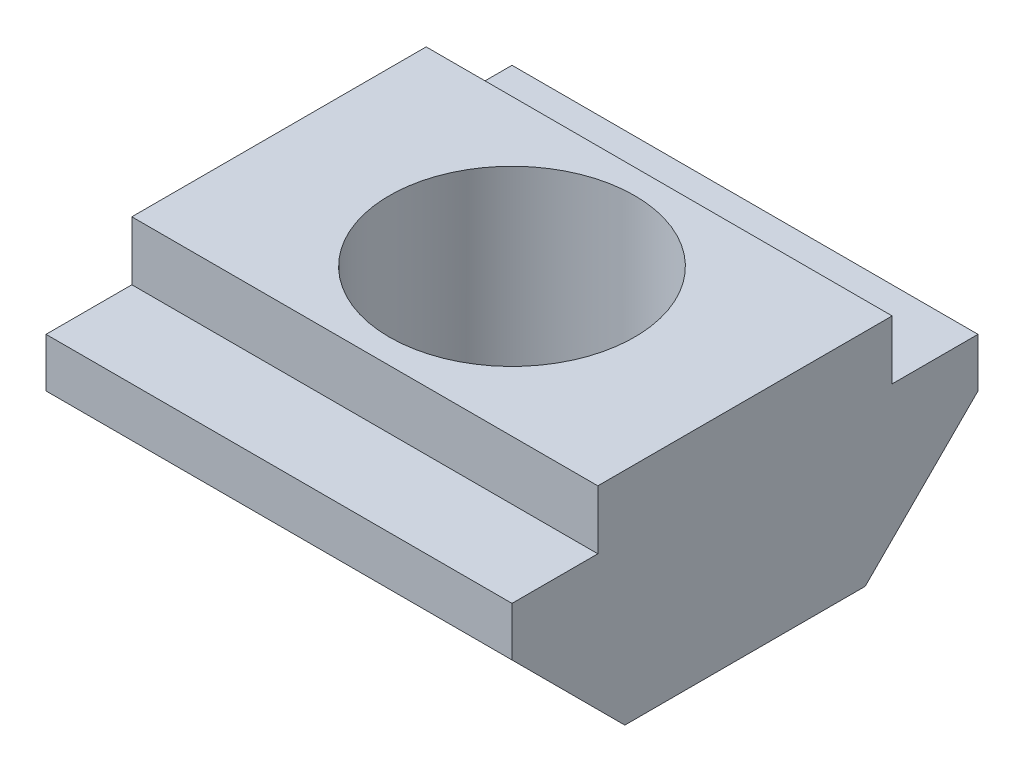
ISO-10303-21;
HEADER;
FILE_DESCRIPTION(('STEP AP214'),'2;1');
FILE_NAME('part.step','',(''),(''),'','','');
FILE_SCHEMA(('AUTOMOTIVE_DESIGN { 1 0 10303 214 1 1 1 1 }'));
ENDSEC;
DATA;
#1=APPLICATION_CONTEXT('core data for automotive mechanical design processes');
#2=APPLICATION_PROTOCOL_DEFINITION('international standard','automotive_design',2000,#1);
#3=PRODUCT_CONTEXT('',#1,'mechanical');
#4=PRODUCT('Part','Part','',(#3));
#5=PRODUCT_RELATED_PRODUCT_CATEGORY('part','',(#4));
#6=PRODUCT_DEFINITION_FORMATION('','',#4);
#7=PRODUCT_DEFINITION_CONTEXT('part definition',#1,'design');
#8=PRODUCT_DEFINITION('design','',#6,#7);
#9=PRODUCT_DEFINITION_SHAPE('','',#8);
#10=(LENGTH_UNIT() NAMED_UNIT(*) SI_UNIT(.MILLI.,.METRE.));
#11=(NAMED_UNIT(*) PLANE_ANGLE_UNIT() SI_UNIT($,.RADIAN.));
#12=(NAMED_UNIT(*) SI_UNIT($,.STERADIAN.) SOLID_ANGLE_UNIT());
#13=UNCERTAINTY_MEASURE_WITH_UNIT(LENGTH_MEASURE(1.E-05),#10,'distance_accuracy_value','');
#14=(GEOMETRIC_REPRESENTATION_CONTEXT(3) GLOBAL_UNCERTAINTY_ASSIGNED_CONTEXT((#13)) GLOBAL_UNIT_ASSIGNED_CONTEXT((#10,
#11,#12)) REPRESENTATION_CONTEXT('',''));
#15=CARTESIAN_POINT('',(0.,0.,0.));
#16=DIRECTION('',(0.,0.,1.));
#17=DIRECTION('',(1.,0.,0.));
#18=AXIS2_PLACEMENT_3D('',#15,#16,#17);
#19=CARTESIAN_POINT('',(0.,0.,0.));
#20=DIRECTION('',(0.,1.,0.));
#21=DIRECTION('',(0.,0.,1.));
#22=AXIS2_PLACEMENT_3D('',#19,#20,#21);
#23=PLANE('',#22);
#24=DIRECTION('',(0.,0.,1.));
#25=VECTOR('',#24,1.);
#26=CARTESIAN_POINT('',(0.,0.,-9.5));
#27=LINE('',#26,#25);
#28=CARTESIAN_POINT('',(0.,0.,-7.20000000000001));
#29=VERTEX_POINT('',#28);
#30=CARTESIAN_POINT('',(0.,0.,-2.30000000000002));
#31=VERTEX_POINT('',#30);
#32=EDGE_CURVE('E154',#29,#31,#27,.T.);
#33=ORIENTED_EDGE('',*,*,#32,.F.);
#34=DIRECTION('',(-1.,0.,0.));
#35=VECTOR('',#34,1.);
#36=CARTESIAN_POINT('',(9.5,0.,-7.20000000000001));
#37=LINE('',#36,#35);
#38=CARTESIAN_POINT('',(4.25250628144672,0.,-7.20000000000001));
#39=VERTEX_POINT('',#38);
#40=EDGE_CURVE('E135',#39,#29,#37,.T.);
#41=ORIENTED_EDGE('',*,*,#40,.F.);
#42=CARTESIAN_POINT('',(4.75,0.,-4.75));
#43=DIRECTION('',(0.,1.,0.));
#44=DIRECTION('',(0.,0.,1.));
#45=AXIS2_PLACEMENT_3D('',#42,#43,#44);
#46=CIRCLE('',#45,2.5);
#47=CARTESIAN_POINT('',(4.25250628144657,0.,-2.30000000000002));
#48=VERTEX_POINT('',#47);
#49=EDGE_CURVE('E185',#39,#48,#46,.T.);
#50=ORIENTED_EDGE('',*,*,#49,.T.);
#51=DIRECTION('',(-1.,0.,0.));
#52=VECTOR('',#51,1.);
#53=CARTESIAN_POINT('',(9.5,0.,-2.30000000000002));
#54=LINE('',#53,#52);
#55=EDGE_CURVE('E55',#48,#31,#54,.T.);
#56=ORIENTED_EDGE('',*,*,#55,.T.);
#57=EDGE_LOOP('',(#33,#41,#50,#56));
#58=FACE_BOUND('',#57,.T.);
#59=ADVANCED_FACE('F39',(#58),#23,.F.);
#60=CARTESIAN_POINT('',(0.,3.3,0.));
#61=DIRECTION('',(0.,1.,0.));
#62=DIRECTION('',(0.,0.,1.));
#63=AXIS2_PLACEMENT_3D('',#60,#61,#62);
#64=PLANE('',#63);
#65=DIRECTION('',(-1.,0.,0.));
#66=VECTOR('',#65,1.);
#67=CARTESIAN_POINT('',(9.5,3.3,-7.75));
#68=LINE('',#67,#66);
#69=CARTESIAN_POINT('',(9.5,3.3,-7.75));
#70=VERTEX_POINT('',#69);
#71=CARTESIAN_POINT('',(0.,3.3,-7.75));
#72=VERTEX_POINT('',#71);
#73=EDGE_CURVE('E206',#70,#72,#68,.T.);
#74=ORIENTED_EDGE('',*,*,#73,.F.);
#75=DIRECTION('',(0.,0.,-1.));
#76=VECTOR('',#75,1.);
#77=CARTESIAN_POINT('',(9.5,3.3,0.));
#78=LINE('',#77,#76);
#79=CARTESIAN_POINT('',(9.5,3.3,-9.5));
#80=VERTEX_POINT('',#79);
#81=EDGE_CURVE('E240',#70,#80,#78,.T.);
#82=ORIENTED_EDGE('',*,*,#81,.T.);
#83=DIRECTION('',(-1.,0.,0.));
#84=VECTOR('',#83,1.);
#85=CARTESIAN_POINT('',(9.5,3.3,-9.5));
#86=LINE('',#85,#84);
#87=CARTESIAN_POINT('',(0.,3.3,-9.5));
#88=VERTEX_POINT('',#87);
#89=EDGE_CURVE('E170',#80,#88,#86,.T.);
#90=ORIENTED_EDGE('',*,*,#89,.T.);
#91=DIRECTION('',(0.,0.,1.));
#92=VECTOR('',#91,1.);
#93=CARTESIAN_POINT('',(0.,3.3,-9.5));
#94=LINE('',#93,#92);
#95=EDGE_CURVE('E158',#88,#72,#94,.T.);
#96=ORIENTED_EDGE('',*,*,#95,.T.);
#97=EDGE_LOOP('',(#74,#82,#90,#96));
#98=FACE_BOUND('',#97,.T.);
#99=ADVANCED_FACE('F247',(#98),#64,.T.);
#100=CARTESIAN_POINT('',(0.,3.3,-9.5));
#101=DIRECTION('',(1.,0.,0.));
#102=DIRECTION('',(0.,0.,-1.));
#103=AXIS2_PLACEMENT_3D('',#100,#101,#102);
#104=PLANE('',#103);
#105=DIRECTION('',(0.,-1.,0.));
#106=VECTOR('',#105,1.);
#107=CARTESIAN_POINT('',(0.,3.3,-9.5));
#108=LINE('',#107,#106);
#109=CARTESIAN_POINT('',(0.,2.3,-9.5));
#110=VERTEX_POINT('',#109);
#111=EDGE_CURVE('E165',#88,#110,#108,.T.);
#112=ORIENTED_EDGE('',*,*,#111,.T.);
#113=DIRECTION('',(0.,0.707106781186549,-0.707106781186546));
#114=VECTOR('',#113,1.);
#115=CARTESIAN_POINT('',(0.,2.3,-9.5));
#116=LINE('',#115,#114);
#117=EDGE_CURVE('E136',#29,#110,#116,.T.);
#118=ORIENTED_EDGE('',*,*,#117,.F.);
#119=ORIENTED_EDGE('',*,*,#32,.T.);
#120=DIRECTION('',(0.,-0.707106781186544,-0.707106781186551));
#121=VECTOR('',#120,1.);
#122=CARTESIAN_POINT('',(0.,2.3,0.));
#123=LINE('',#122,#121);
#124=CARTESIAN_POINT('',(0.,2.3,0.));
#125=VERTEX_POINT('',#124);
#126=EDGE_CURVE('E275',#125,#31,#123,.T.);
#127=ORIENTED_EDGE('',*,*,#126,.F.);
#128=DIRECTION('',(0.,-1.,0.));
#129=VECTOR('',#128,1.);
#130=CARTESIAN_POINT('',(0.,3.3,0.));
#131=LINE('',#130,#129);
#132=CARTESIAN_POINT('',(0.,3.3,0.));
#133=VERTEX_POINT('',#132);
#134=EDGE_CURVE('E176',#133,#125,#131,.T.);
#135=ORIENTED_EDGE('',*,*,#134,.F.);
#136=CARTESIAN_POINT('',(0.,3.3,-1.75));
#137=VERTEX_POINT('',#136);
#138=EDGE_CURVE('E153',#137,#133,#94,.T.);
#139=ORIENTED_EDGE('',*,*,#138,.F.);
#140=DIRECTION('',(0.,-1.,0.));
#141=VECTOR('',#140,1.);
#142=CARTESIAN_POINT('',(0.,4.5,-1.75));
#143=LINE('',#142,#141);
#144=CARTESIAN_POINT('',(0.,4.5,-1.75));
#145=VERTEX_POINT('',#144);
#146=EDGE_CURVE('E161',#145,#137,#143,.T.);
#147=ORIENTED_EDGE('',*,*,#146,.F.);
#148=DIRECTION('',(0.,0.,1.));
#149=VECTOR('',#148,1.);
#150=CARTESIAN_POINT('',(0.,4.5,-7.75));
#151=LINE('',#150,#149);
#152=CARTESIAN_POINT('',(0.,4.5,-7.75));
#153=VERTEX_POINT('',#152);
#154=EDGE_CURVE('E201',#153,#145,#151,.T.);
#155=ORIENTED_EDGE('',*,*,#154,.F.);
#156=DIRECTION('',(0.,-1.,0.));
#157=VECTOR('',#156,1.);
#158=CARTESIAN_POINT('',(0.,4.5,-7.75));
#159=LINE('',#158,#157);
#160=EDGE_CURVE('E215',#153,#72,#159,.T.);
#161=ORIENTED_EDGE('',*,*,#160,.T.);
#162=ORIENTED_EDGE('',*,*,#95,.F.);
#163=EDGE_LOOP('',(#112,#118,#119,#127,#135,#139,#147,#155,#161,#162));
#164=FACE_BOUND('',#163,.T.);
#165=ADVANCED_FACE('F41',(#164),#104,.F.);
#166=CARTESIAN_POINT('',(0.,3.3,0.));
#167=DIRECTION('',(0.,0.,-1.));
#168=DIRECTION('',(-1.,0.,0.));
#169=AXIS2_PLACEMENT_3D('',#166,#167,#168);
#170=PLANE('',#169);
#171=ORIENTED_EDGE('',*,*,#134,.T.);
#172=DIRECTION('',(-1.,0.,0.));
#173=VECTOR('',#172,1.);
#174=CARTESIAN_POINT('',(9.5,2.3,0.));
#175=LINE('',#174,#173);
#176=CARTESIAN_POINT('',(9.5,2.3,0.));
#177=VERTEX_POINT('',#176);
#178=EDGE_CURVE('E198',#177,#125,#175,.T.);
#179=ORIENTED_EDGE('',*,*,#178,.F.);
#180=DIRECTION('',(0.,-1.,0.));
#181=VECTOR('',#180,1.);
#182=CARTESIAN_POINT('',(9.5,3.3,0.));
#183=LINE('',#182,#181);
#184=CARTESIAN_POINT('',(9.5,3.3,0.));
#185=VERTEX_POINT('',#184);
#186=EDGE_CURVE('E173',#185,#177,#183,.T.);
#187=ORIENTED_EDGE('',*,*,#186,.F.);
#188=DIRECTION('',(1.,0.,0.));
#189=VECTOR('',#188,1.);
#190=CARTESIAN_POINT('',(0.,3.3,0.));
#191=LINE('',#190,#189);
#192=EDGE_CURVE('E237',#133,#185,#191,.T.);
#193=ORIENTED_EDGE('',*,*,#192,.F.);
#194=EDGE_LOOP('',(#171,#179,#187,#193));
#195=FACE_BOUND('',#194,.T.);
#196=ADVANCED_FACE('F278',(#195),#170,.F.);
#197=CARTESIAN_POINT('',(9.5,3.3,0.));
#198=DIRECTION('',(-1.,0.,0.));
#199=DIRECTION('',(0.,0.,1.));
#200=AXIS2_PLACEMENT_3D('',#197,#198,#199);
#201=PLANE('',#200);
#202=DIRECTION('',(0.,0.,-1.));
#203=VECTOR('',#202,1.);
#204=CARTESIAN_POINT('',(9.5,0.,0.));
#205=LINE('',#204,#203);
#206=CARTESIAN_POINT('',(9.5,0.,-2.30000000000002));
#207=VERTEX_POINT('',#206);
#208=CARTESIAN_POINT('',(9.5,0.,-7.20000000000001));
#209=VERTEX_POINT('',#208);
#210=EDGE_CURVE('E143',#207,#209,#205,.T.);
#211=ORIENTED_EDGE('',*,*,#210,.T.);
#212=DIRECTION('',(0.,0.707106781186549,-0.707106781186546));
#213=VECTOR('',#212,1.);
#214=CARTESIAN_POINT('',(9.5,2.3,-9.5));
#215=LINE('',#214,#213);
#216=CARTESIAN_POINT('',(9.5,2.3,-9.5));
#217=VERTEX_POINT('',#216);
#218=EDGE_CURVE('E126',#209,#217,#215,.T.);
#219=ORIENTED_EDGE('',*,*,#218,.T.);
#220=DIRECTION('',(0.,-1.,0.));
#221=VECTOR('',#220,1.);
#222=CARTESIAN_POINT('',(9.5,3.3,-9.5));
#223=LINE('',#222,#221);
#224=EDGE_CURVE('E169',#80,#217,#223,.T.);
#225=ORIENTED_EDGE('',*,*,#224,.F.);
#226=ORIENTED_EDGE('',*,*,#81,.F.);
#227=DIRECTION('',(0.,-1.,0.));
#228=VECTOR('',#227,1.);
#229=CARTESIAN_POINT('',(9.5,4.5,-7.75));
#230=LINE('',#229,#228);
#231=CARTESIAN_POINT('',(9.5,4.5,-7.75));
#232=VERTEX_POINT('',#231);
#233=EDGE_CURVE('E225',#232,#70,#230,.T.);
#234=ORIENTED_EDGE('',*,*,#233,.F.);
#235=DIRECTION('',(0.,0.,-1.));
#236=VECTOR('',#235,1.);
#237=CARTESIAN_POINT('',(9.5,4.5,-1.75));
#238=LINE('',#237,#236);
#239=CARTESIAN_POINT('',(9.5,4.5,-1.75));
#240=VERTEX_POINT('',#239);
#241=EDGE_CURVE('E209',#240,#232,#238,.T.);
#242=ORIENTED_EDGE('',*,*,#241,.F.);
#243=DIRECTION('',(0.,-1.,0.));
#244=VECTOR('',#243,1.);
#245=CARTESIAN_POINT('',(9.5,4.5,-1.75));
#246=LINE('',#245,#244);
#247=CARTESIAN_POINT('',(9.5,3.3,-1.75));
#248=VERTEX_POINT('',#247);
#249=EDGE_CURVE('E229',#240,#248,#246,.T.);
#250=ORIENTED_EDGE('',*,*,#249,.T.);
#251=EDGE_CURVE('E241',#185,#248,#78,.T.);
#252=ORIENTED_EDGE('',*,*,#251,.F.);
#253=ORIENTED_EDGE('',*,*,#186,.T.);
#254=DIRECTION('',(0.,-0.707106781186544,-0.707106781186551));
#255=VECTOR('',#254,1.);
#256=CARTESIAN_POINT('',(9.5,2.3,0.));
#257=LINE('',#256,#255);
#258=EDGE_CURVE('E151',#177,#207,#257,.T.);
#259=ORIENTED_EDGE('',*,*,#258,.T.);
#260=EDGE_LOOP('',(#211,#219,#225,#226,#234,#242,#250,#252,#253,#259));
#261=FACE_BOUND('',#260,.T.);
#262=ADVANCED_FACE('F149',(#261),#201,.F.);
#263=CARTESIAN_POINT('',(9.5,3.3,-9.5));
#264=DIRECTION('',(0.,0.,1.));
#265=DIRECTION('',(1.,0.,0.));
#266=AXIS2_PLACEMENT_3D('',#263,#264,#265);
#267=PLANE('',#266);
#268=ORIENTED_EDGE('',*,*,#224,.T.);
#269=DIRECTION('',(-1.,0.,0.));
#270=VECTOR('',#269,1.);
#271=CARTESIAN_POINT('',(9.5,2.3,-9.5));
#272=LINE('',#271,#270);
#273=EDGE_CURVE('E129',#217,#110,#272,.T.);
#274=ORIENTED_EDGE('',*,*,#273,.T.);
#275=ORIENTED_EDGE('',*,*,#111,.F.);
#276=ORIENTED_EDGE('',*,*,#89,.F.);
#277=EDGE_LOOP('',(#268,#274,#275,#276));
#278=FACE_BOUND('',#277,.T.);
#279=ADVANCED_FACE('F251',(#278),#267,.F.);
#280=DIRECTION('',(1.,0.,0.));
#281=VECTOR('',#280,1.);
#282=CARTESIAN_POINT('',(0.,3.3,-1.75));
#283=LINE('',#282,#281);
#284=EDGE_CURVE('E194',#137,#248,#283,.T.);
#285=ORIENTED_EDGE('',*,*,#284,.F.);
#286=ORIENTED_EDGE('',*,*,#138,.T.);
#287=ORIENTED_EDGE('',*,*,#192,.T.);
#288=ORIENTED_EDGE('',*,*,#251,.T.);
#289=EDGE_LOOP('',(#285,#286,#287,#288));
#290=FACE_BOUND('',#289,.T.);
#291=ADVANCED_FACE('F271',(#290),#64,.T.);
#292=CARTESIAN_POINT('',(5.24749371855343,0.,-2.30000000000002));
#293=VERTEX_POINT('',#292);
#294=CARTESIAN_POINT('',(5.24749371855328,0.,-7.20000000000001));
#295=VERTEX_POINT('',#294);
#296=EDGE_CURVE('E145',#293,#295,#46,.T.);
#297=ORIENTED_EDGE('',*,*,#296,.T.);
#298=EDGE_CURVE('E63',#209,#295,#37,.T.);
#299=ORIENTED_EDGE('',*,*,#298,.F.);
#300=ORIENTED_EDGE('',*,*,#210,.F.);
#301=EDGE_CURVE('E283',#207,#293,#54,.T.);
#302=ORIENTED_EDGE('',*,*,#301,.T.);
#303=EDGE_LOOP('',(#297,#299,#300,#302));
#304=FACE_BOUND('',#303,.T.);
#305=ADVANCED_FACE('F141',(#304),#23,.F.);
#306=CARTESIAN_POINT('',(0.,4.5,-1.75));
#307=DIRECTION('',(0.,0.,-1.));
#308=DIRECTION('',(-1.,0.,0.));
#309=AXIS2_PLACEMENT_3D('',#306,#307,#308);
#310=PLANE('',#309);
#311=ORIENTED_EDGE('',*,*,#284,.T.);
#312=ORIENTED_EDGE('',*,*,#249,.F.);
#313=DIRECTION('',(1.,0.,0.));
#314=VECTOR('',#313,1.);
#315=CARTESIAN_POINT('',(0.,4.5,-1.75));
#316=LINE('',#315,#314);
#317=EDGE_CURVE('E205',#145,#240,#316,.T.);
#318=ORIENTED_EDGE('',*,*,#317,.F.);
#319=ORIENTED_EDGE('',*,*,#146,.T.);
#320=EDGE_LOOP('',(#311,#312,#318,#319));
#321=FACE_BOUND('',#320,.T.);
#322=ADVANCED_FACE('F268',(#321),#310,.F.);
#323=CARTESIAN_POINT('',(9.5,4.5,-7.75));
#324=DIRECTION('',(0.,0.,1.));
#325=DIRECTION('',(1.,0.,0.));
#326=AXIS2_PLACEMENT_3D('',#323,#324,#325);
#327=PLANE('',#326);
#328=ORIENTED_EDGE('',*,*,#73,.T.);
#329=ORIENTED_EDGE('',*,*,#160,.F.);
#330=DIRECTION('',(-1.,0.,0.));
#331=VECTOR('',#330,1.);
#332=CARTESIAN_POINT('',(9.5,4.5,-7.75));
#333=LINE('',#332,#331);
#334=EDGE_CURVE('E212',#232,#153,#333,.T.);
#335=ORIENTED_EDGE('',*,*,#334,.F.);
#336=ORIENTED_EDGE('',*,*,#233,.T.);
#337=EDGE_LOOP('',(#328,#329,#335,#336));
#338=FACE_BOUND('',#337,.T.);
#339=ADVANCED_FACE('F259',(#338),#327,.F.);
#340=CARTESIAN_POINT('',(0.,4.5,0.));
#341=DIRECTION('',(0.,1.,0.));
#342=DIRECTION('',(0.,0.,1.));
#343=AXIS2_PLACEMENT_3D('',#340,#341,#342);
#344=PLANE('',#343);
#345=CARTESIAN_POINT('',(4.75,4.5,-4.75));
#346=DIRECTION('',(0.,1.,0.));
#347=DIRECTION('',(0.,0.,1.));
#348=AXIS2_PLACEMENT_3D('',#345,#346,#347);
#349=CIRCLE('',#348,2.5);
#350=CARTESIAN_POINT('',(4.75,4.5,-2.25));
#351=VERTEX_POINT('',#350);
#352=EDGE_CURVE('E190',#351,#351,#349,.T.);
#353=ORIENTED_EDGE('',*,*,#352,.F.);
#354=EDGE_LOOP('',(#353));
#355=FACE_BOUND('',#354,.T.);
#356=ORIENTED_EDGE('',*,*,#154,.T.);
#357=ORIENTED_EDGE('',*,*,#317,.T.);
#358=ORIENTED_EDGE('',*,*,#241,.T.);
#359=ORIENTED_EDGE('',*,*,#334,.T.);
#360=EDGE_LOOP('',(#356,#357,#358,#359));
#361=FACE_BOUND('',#360,.T.);
#362=ADVANCED_FACE('F266',(#355,#361),#344,.T.);
#363=CARTESIAN_POINT('',(4.75,0.,-4.75));
#364=DIRECTION('',(0.,1.,0.));
#365=DIRECTION('',(0.,0.,1.));
#366=AXIS2_PLACEMENT_3D('',#363,#364,#365);
#367=CYLINDRICAL_SURFACE('',#366,2.5);
#368=ORIENTED_EDGE('',*,*,#49,.F.);
#369=CARTESIAN_POINT('',(4.75,-2.45000000000002,-4.75));
#370=DIRECTION('',(0.,0.707106781186546,0.707106781186549));
#371=DIRECTION('',(0.,0.707106781186549,-0.707106781186546));
#372=AXIS2_PLACEMENT_3D('',#369,#370,#371);
#373=ELLIPSE('',#372,3.53553390593275,2.5);
#374=EDGE_CURVE('E11',#39,#295,#373,.F.);
#375=ORIENTED_EDGE('',*,*,#374,.T.);
#376=ORIENTED_EDGE('',*,*,#296,.F.);
#377=CARTESIAN_POINT('',(4.75,-2.44999999999995,-4.75));
#378=DIRECTION('',(0.,0.707106781186551,-0.707106781186544));
#379=DIRECTION('',(0.,0.707106781186544,0.707106781186551));
#380=AXIS2_PLACEMENT_3D('',#377,#378,#379);
#381=ELLIPSE('',#380,3.53553390593272,2.5);
#382=EDGE_CURVE('E48',#293,#48,#381,.F.);
#383=ORIENTED_EDGE('',*,*,#382,.T.);
#384=EDGE_LOOP('',(#368,#375,#376,#383));
#385=FACE_BOUND('',#384,.T.);
#386=ORIENTED_EDGE('',*,*,#352,.T.);
#387=EDGE_LOOP('',(#386));
#388=FACE_BOUND('',#387,.T.);
#389=ADVANCED_FACE('F183',(#385,#388),#367,.F.);
#390=CARTESIAN_POINT('',(9.5,2.3,0.));
#391=DIRECTION('',(0.,0.707106781186551,-0.707106781186544));
#392=DIRECTION('',(0.,0.707106781186544,0.707106781186551));
#393=AXIS2_PLACEMENT_3D('',#390,#391,#392);
#394=PLANE('',#393);
#395=ORIENTED_EDGE('',*,*,#301,.F.);
#396=ORIENTED_EDGE('',*,*,#258,.F.);
#397=ORIENTED_EDGE('',*,*,#178,.T.);
#398=ORIENTED_EDGE('',*,*,#126,.T.);
#399=ORIENTED_EDGE('',*,*,#55,.F.);
#400=ORIENTED_EDGE('',*,*,#382,.F.);
#401=EDGE_LOOP('',(#395,#396,#397,#398,#399,#400));
#402=FACE_BOUND('',#401,.T.);
#403=ADVANCED_FACE('F293',(#402),#394,.F.);
#404=CARTESIAN_POINT('',(9.5,2.3,-9.5));
#405=DIRECTION('',(0.,0.707106781186546,0.707106781186549));
#406=DIRECTION('',(0.,-0.707106781186549,0.707106781186546));
#407=AXIS2_PLACEMENT_3D('',#404,#405,#406);
#408=PLANE('',#407);
#409=ORIENTED_EDGE('',*,*,#40,.T.);
#410=ORIENTED_EDGE('',*,*,#117,.T.);
#411=ORIENTED_EDGE('',*,*,#273,.F.);
#412=ORIENTED_EDGE('',*,*,#218,.F.);
#413=ORIENTED_EDGE('',*,*,#298,.T.);
#414=ORIENTED_EDGE('',*,*,#374,.F.);
#415=EDGE_LOOP('',(#409,#410,#411,#412,#413,#414));
#416=FACE_BOUND('',#415,.T.);
#417=ADVANCED_FACE('F127',(#416),#408,.F.);
#418=CLOSED_SHELL('',(#59,#99,#165,#196,#262,#279,#291,#305,#322,#339,#362,#389,#403,#417));
#419=MANIFOLD_SOLID_BREP('B2',#418);
#420=ADVANCED_BREP_SHAPE_REPRESENTATION('',(#18,#419),#14);
#421=SHAPE_DEFINITION_REPRESENTATION(#9,#420);
ENDSEC;
END-ISO-10303-21;
